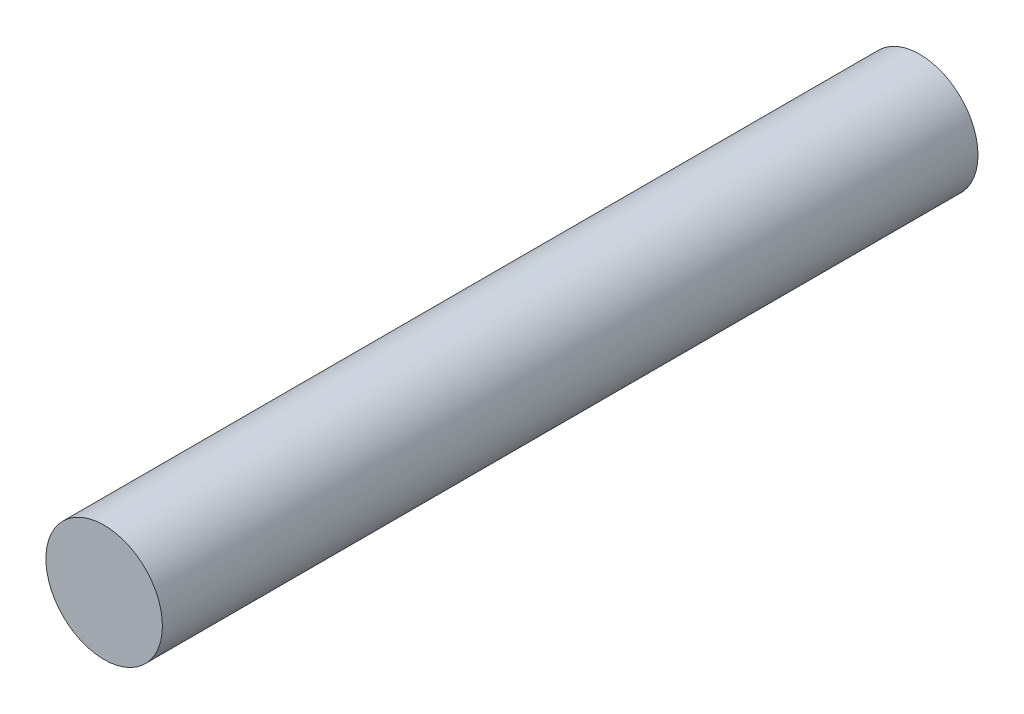
ISO-10303-21;
HEADER;
FILE_DESCRIPTION(('STEP AP214'),'2;1');
FILE_NAME('part.step','',(''),(''),'','','');
FILE_SCHEMA(('AUTOMOTIVE_DESIGN { 1 0 10303 214 1 1 1 1 }'));
ENDSEC;
DATA;
#1=APPLICATION_CONTEXT('core data for automotive mechanical design processes');
#2=APPLICATION_PROTOCOL_DEFINITION('international standard','automotive_design',2000,#1);
#3=PRODUCT_CONTEXT('',#1,'mechanical');
#4=PRODUCT('Part','Part','',(#3));
#5=PRODUCT_RELATED_PRODUCT_CATEGORY('part','',(#4));
#6=PRODUCT_DEFINITION_FORMATION('','',#4);
#7=PRODUCT_DEFINITION_CONTEXT('part definition',#1,'design');
#8=PRODUCT_DEFINITION('design','',#6,#7);
#9=PRODUCT_DEFINITION_SHAPE('','',#8);
#10=(LENGTH_UNIT() NAMED_UNIT(*) SI_UNIT(.MILLI.,.METRE.));
#11=(NAMED_UNIT(*) PLANE_ANGLE_UNIT() SI_UNIT($,.RADIAN.));
#12=(NAMED_UNIT(*) SI_UNIT($,.STERADIAN.) SOLID_ANGLE_UNIT());
#13=UNCERTAINTY_MEASURE_WITH_UNIT(LENGTH_MEASURE(1.E-05),#10,'distance_accuracy_value','');
#14=(GEOMETRIC_REPRESENTATION_CONTEXT(3) GLOBAL_UNCERTAINTY_ASSIGNED_CONTEXT((#13)) GLOBAL_UNIT_ASSIGNED_CONTEXT((#10,
#11,#12)) REPRESENTATION_CONTEXT('',''));
#15=CARTESIAN_POINT('',(0.,0.,0.));
#16=DIRECTION('',(0.,0.,1.));
#17=DIRECTION('',(1.,0.,0.));
#18=AXIS2_PLACEMENT_3D('',#15,#16,#17);
#19=CARTESIAN_POINT('',(0.,0.,14.));
#20=DIRECTION('',(0.,0.,-1.));
#21=DIRECTION('',(-1.,0.,0.));
#22=AXIS2_PLACEMENT_3D('',#19,#20,#21);
#23=CYLINDRICAL_SURFACE('',#22,1.);
#24=CARTESIAN_POINT('',(0.,0.,14.));
#25=DIRECTION('',(0.,0.,1.));
#26=DIRECTION('',(1.,0.,0.));
#27=AXIS2_PLACEMENT_3D('',#24,#25,#26);
#28=CIRCLE('',#27,1.);
#29=CARTESIAN_POINT('',(1.,0.,14.));
#30=VERTEX_POINT('',#29);
#31=EDGE_CURVE('E10',#30,#30,#28,.T.);
#32=ORIENTED_EDGE('',*,*,#31,.F.);
#33=EDGE_LOOP('',(#32));
#34=FACE_BOUND('',#33,.T.);
#35=CARTESIAN_POINT('',(0.,0.,0.));
#36=DIRECTION('',(0.,0.,1.));
#37=DIRECTION('',(1.,0.,0.));
#38=AXIS2_PLACEMENT_3D('',#35,#36,#37);
#39=CIRCLE('',#38,1.);
#40=CARTESIAN_POINT('',(1.,0.,0.));
#41=VERTEX_POINT('',#40);
#42=EDGE_CURVE('E38',#41,#41,#39,.T.);
#43=ORIENTED_EDGE('',*,*,#42,.T.);
#44=EDGE_LOOP('',(#43));
#45=FACE_BOUND('',#44,.T.);
#46=ADVANCED_FACE('F35',(#34,#45),#23,.T.);
#47=CARTESIAN_POINT('',(0.,0.,14.));
#48=DIRECTION('',(0.,0.,1.));
#49=DIRECTION('',(1.,0.,0.));
#50=AXIS2_PLACEMENT_3D('',#47,#48,#49);
#51=PLANE('',#50);
#52=ORIENTED_EDGE('',*,*,#31,.T.);
#53=EDGE_LOOP('',(#52));
#54=FACE_BOUND('',#53,.T.);
#55=ADVANCED_FACE('F50',(#54),#51,.T.);
#56=CARTESIAN_POINT('',(0.,0.,0.));
#57=DIRECTION('',(0.,0.,1.));
#58=DIRECTION('',(1.,0.,0.));
#59=AXIS2_PLACEMENT_3D('',#56,#57,#58);
#60=PLANE('',#59);
#61=ORIENTED_EDGE('',*,*,#42,.F.);
#62=EDGE_LOOP('',(#61));
#63=FACE_BOUND('',#62,.T.);
#64=ADVANCED_FACE('F48',(#63),#60,.F.);
#65=CLOSED_SHELL('',(#46,#55,#64));
#66=MANIFOLD_SOLID_BREP('B2',#65);
#67=ADVANCED_BREP_SHAPE_REPRESENTATION('',(#18,#66),#14);
#68=SHAPE_DEFINITION_REPRESENTATION(#9,#67);
ENDSEC;
END-ISO-10303-21;
